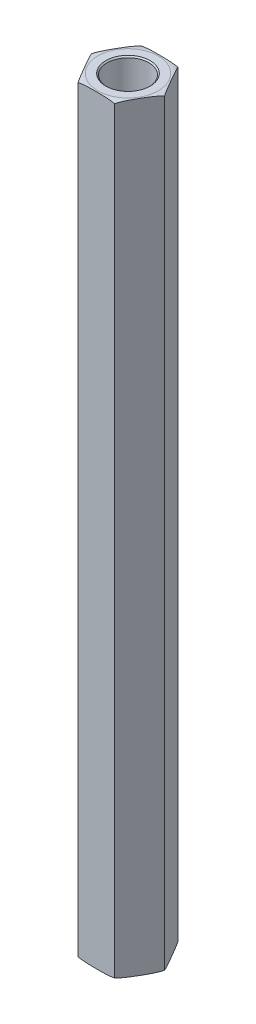
ISO-10303-21;
HEADER;
FILE_DESCRIPTION(('STEP AP214'),'2;1');
FILE_NAME('part.step','',(''),(''),'','','');
FILE_SCHEMA(('AUTOMOTIVE_DESIGN { 1 0 10303 214 1 1 1 1 }'));
ENDSEC;
DATA;
#1=APPLICATION_CONTEXT('core data for automotive mechanical design processes');
#2=APPLICATION_PROTOCOL_DEFINITION('international standard','automotive_design',2000,#1);
#3=PRODUCT_CONTEXT('',#1,'mechanical');
#4=PRODUCT('Part','Part','',(#3));
#5=PRODUCT_RELATED_PRODUCT_CATEGORY('part','',(#4));
#6=PRODUCT_DEFINITION_FORMATION('','',#4);
#7=PRODUCT_DEFINITION_CONTEXT('part definition',#1,'design');
#8=PRODUCT_DEFINITION('design','',#6,#7);
#9=PRODUCT_DEFINITION_SHAPE('','',#8);
#10=(LENGTH_UNIT() NAMED_UNIT(*) SI_UNIT(.MILLI.,.METRE.));
#11=(NAMED_UNIT(*) PLANE_ANGLE_UNIT() SI_UNIT($,.RADIAN.));
#12=(NAMED_UNIT(*) SI_UNIT($,.STERADIAN.) SOLID_ANGLE_UNIT());
#13=UNCERTAINTY_MEASURE_WITH_UNIT(LENGTH_MEASURE(1.E-05),#10,'distance_accuracy_value','');
#14=(GEOMETRIC_REPRESENTATION_CONTEXT(3) GLOBAL_UNCERTAINTY_ASSIGNED_CONTEXT((#13)) GLOBAL_UNIT_ASSIGNED_CONTEXT((#10,
#11,#12)) REPRESENTATION_CONTEXT('',''));
#15=CARTESIAN_POINT('',(0.,0.,0.));
#16=DIRECTION('',(0.,0.,1.));
#17=DIRECTION('',(1.,0.,0.));
#18=AXIS2_PLACEMENT_3D('',#15,#16,#17);
#19=CARTESIAN_POINT('',(0.,25.4,0.));
#20=DIRECTION('',(0.,1.,0.));
#21=DIRECTION('',(0.,0.,1.));
#22=AXIS2_PLACEMENT_3D('',#19,#20,#21);
#23=PLANE('',#22);
#24=CARTESIAN_POINT('',(0.,25.4,0.));
#25=DIRECTION('',(0.,1.,0.));
#26=DIRECTION('',(0.,0.,1.));
#27=AXIS2_PLACEMENT_3D('',#24,#25,#26);
#28=CIRCLE('',#27,2.0955);
#29=CARTESIAN_POINT('',(0.,25.4,2.0955));
#30=VERTEX_POINT('',#29);
#31=EDGE_CURVE('E301',#30,#30,#28,.T.);
#32=ORIENTED_EDGE('',*,*,#31,.T.);
#33=EDGE_LOOP('',(#32));
#34=FACE_BOUND('',#33,.T.);
#35=ADVANCED_FACE('F15',(#34),#23,.T.);
#36=CARTESIAN_POINT('',(0.,-25.4,0.));
#37=DIRECTION('',(0.,-1.,0.));
#38=DIRECTION('',(0.,0.,-1.));
#39=AXIS2_PLACEMENT_3D('',#36,#37,#38);
#40=PLANE('',#39);
#41=CARTESIAN_POINT('',(0.,-25.4,0.));
#42=DIRECTION('',(0.,-1.,0.));
#43=DIRECTION('',(0.,0.,-1.));
#44=AXIS2_PLACEMENT_3D('',#41,#42,#43);
#45=CIRCLE('',#44,2.0955);
#46=CARTESIAN_POINT('',(0.,-25.4,-2.0955));
#47=VERTEX_POINT('',#46);
#48=EDGE_CURVE('E311',#47,#47,#45,.T.);
#49=ORIENTED_EDGE('',*,*,#48,.T.);
#50=EDGE_LOOP('',(#49));
#51=FACE_BOUND('',#50,.T.);
#52=ADVANCED_FACE('F412',(#51),#40,.T.);
#53=CARTESIAN_POINT('',(0.,25.4,0.));
#54=DIRECTION('',(0.,1.,0.));
#55=DIRECTION('',(0.,0.,1.));
#56=AXIS2_PLACEMENT_3D('',#53,#54,#55);
#57=CYLINDRICAL_SURFACE('',#56,2.0955);
#58=CARTESIAN_POINT('',(0.,37.9730000000222,0.));
#59=DIRECTION('',(0.,1.,0.));
#60=DIRECTION('',(0.,0.,1.));
#61=AXIS2_PLACEMENT_3D('',#58,#59,#60);
#62=CIRCLE('',#61,2.09549999999581);
#63=CARTESIAN_POINT('',(0.,37.9730000000222,2.09549999999581));
#64=VERTEX_POINT('',#63);
#65=EDGE_CURVE('E313',#64,#64,#62,.T.);
#66=ORIENTED_EDGE('',*,*,#65,.T.);
#67=EDGE_LOOP('',(#66));
#68=FACE_BOUND('',#67,.T.);
#69=ORIENTED_EDGE('',*,*,#31,.F.);
#70=EDGE_LOOP('',(#69));
#71=FACE_BOUND('',#70,.T.);
#72=ADVANCED_FACE('F323',(#68,#71),#57,.F.);
#73=CARTESIAN_POINT('',(0.,-25.4,0.));
#74=DIRECTION('',(0.,-1.,0.));
#75=DIRECTION('',(0.,0.,-1.));
#76=AXIS2_PLACEMENT_3D('',#73,#74,#75);
#77=CYLINDRICAL_SURFACE('',#76,2.0955);
#78=ORIENTED_EDGE('',*,*,#48,.F.);
#79=EDGE_LOOP('',(#78));
#80=FACE_BOUND('',#79,.T.);
#81=CARTESIAN_POINT('',(0.,-37.9729999999654,0.));
#82=DIRECTION('',(0.,-1.,0.));
#83=DIRECTION('',(0.,0.,-1.));
#84=AXIS2_PLACEMENT_3D('',#81,#82,#83);
#85=CIRCLE('',#84,2.09549999999581);
#86=CARTESIAN_POINT('',(0.,-37.9729999999654,-2.09549999999581));
#87=VERTEX_POINT('',#86);
#88=EDGE_CURVE('E153',#87,#87,#85,.T.);
#89=ORIENTED_EDGE('',*,*,#88,.T.);
#90=EDGE_LOOP('',(#89));
#91=FACE_BOUND('',#90,.T.);
#92=ADVANCED_FACE('F328',(#80,#91),#77,.F.);
#93=CARTESIAN_POINT('',(0.,38.099999999929,0.));
#94=DIRECTION('',(0.,1.,0.));
#95=DIRECTION('',(0.,0.,1.));
#96=AXIS2_PLACEMENT_3D('',#93,#94,#95);
#97=CONICAL_SURFACE('',#96,2.22249999990254,0.785398163397448);
#98=CARTESIAN_POINT('',(0.,38.1000000000427,0.));
#99=DIRECTION('',(0.,1.,0.));
#100=DIRECTION('',(0.,0.,1.));
#101=AXIS2_PLACEMENT_3D('',#98,#99,#100);
#102=CIRCLE('',#101,2.22250000001623);
#103=CARTESIAN_POINT('',(0.,38.1000000000427,2.22250000001623));
#104=VERTEX_POINT('',#103);
#105=EDGE_CURVE('E78',#104,#104,#102,.T.);
#106=ORIENTED_EDGE('',*,*,#105,.T.);
#107=EDGE_LOOP('',(#106));
#108=FACE_BOUND('',#107,.T.);
#109=ORIENTED_EDGE('',*,*,#65,.F.);
#110=EDGE_LOOP('',(#109));
#111=FACE_BOUND('',#110,.T.);
#112=ADVANCED_FACE('F326',(#108,#111),#97,.F.);
#113=CARTESIAN_POINT('',(-3.66617420935413,38.1,0.));
#114=DIRECTION('',(0.866025403784439,0.,-0.499999999999999));
#115=DIRECTION('',(-0.499999999999999,0.,-0.866025403784439));
#116=AXIS2_PLACEMENT_3D('',#113,#114,#115);
#117=PLANE('',#116);
#118=DIRECTION('',(0.,1.,0.));
#119=VECTOR('',#118,1.);
#120=CARTESIAN_POINT('',(-1.83308710467708,38.1,3.175));
#121=LINE('',#120,#119);
#122=CARTESIAN_POINT('',(-1.83308710467708,-37.973,3.17499999999999));
#123=VERTEX_POINT('',#122);
#124=CARTESIAN_POINT('',(-1.83308710467706,37.973,3.175));
#125=VERTEX_POINT('',#124);
#126=EDGE_CURVE('E74',#123,#125,#121,.T.);
#127=ORIENTED_EDGE('',*,*,#126,.T.);
#128=CARTESIAN_POINT('',(-3.66617420935412,37.973,0.));
#129=CARTESIAN_POINT('',(-3.62797961467394,37.9889014148997,0.0661549785605816));
#130=CARTESIAN_POINT('',(-3.58956810864155,38.0024886076105,0.132685658603915));
#131=CARTESIAN_POINT('',(-3.51249051795707,38.0258161979402,0.266187961794431));
#132=CARTESIAN_POINT('',(-3.47382473049842,38.0355604771397,0.333159070187479));
#133=CARTESIAN_POINT('',(-3.39641631867867,38.0519966530451,0.467234372392503));
#134=CARTESIAN_POINT('',(-3.35767399633305,38.0586945328669,0.534338043098323));
#135=CARTESIAN_POINT('',(-3.28009834620104,38.0697767572932,0.668703010557154));
#136=CARTESIAN_POINT('',(-3.24126499587761,38.074160450474,0.735964346345458));
#137=CARTESIAN_POINT('',(-3.16354065964303,38.0812403004263,0.870586845688321));
#138=CARTESIAN_POINT('',(-3.12464965374463,38.0839355237591,0.937948043861809));
#139=CARTESIAN_POINT('',(-3.04685144594578,38.0881531983713,1.07269849250722));
#140=CARTESIAN_POINT('',(-3.00794424351953,38.0896756080272,1.14008774388984));
#141=CARTESIAN_POINT('',(-2.93051517598855,38.091922705889,1.27419882283618));
#142=CARTESIAN_POINT('',(-2.89199336248915,38.0926552468181,1.34092056101683));
#143=CARTESIAN_POINT('',(-2.81494778346123,38.0935767302574,1.47436741839176));
#144=CARTESIAN_POINT('',(-2.77642401791417,38.0937656658949,1.54109253761813));
#145=CARTESIAN_POINT('',(-2.69935964430989,38.0936659966806,1.67457194815423));
#146=CARTESIAN_POINT('',(-2.66081903631797,38.0933771811765,1.74132623935083));
#147=CARTESIAN_POINT('',(-2.58373908085303,38.092221986219,1.87483263846124));
#148=CARTESIAN_POINT('',(-2.54519973341218,38.0913555970386,1.94158474631935));
#149=CARTESIAN_POINT('',(-2.46812969629742,38.0887861940656,2.07507396634334));
#150=CARTESIAN_POINT('',(-2.42959900625935,38.0870832271616,2.14181107913996));
#151=CARTESIAN_POINT('',(-2.35255651340877,38.0824387229726,2.27525259109893));
#152=CARTESIAN_POINT('',(-2.3140447097541,38.0794972471358,2.34195699171993));
#153=CARTESIAN_POINT('',(-2.25084206239913,38.0732174124748,2.4514271881116));
#154=CARTESIAN_POINT('',(-2.2261384933698,38.0703980110463,2.49421502479868));
#155=CARTESIAN_POINT('',(-2.17676945272202,38.0638696794303,2.57972471152158));
#156=CARTESIAN_POINT('',(-2.15210397034159,38.0601610809139,2.62244658019767));
#157=CARTESIAN_POINT('',(-2.10282753811676,38.0516802711496,2.70779586442681));
#158=CARTESIAN_POINT('',(-2.07821657107511,38.0469084657008,2.75042330976635));
#159=CARTESIAN_POINT('',(-2.02900094683535,38.0360987712516,2.83566727147582));
#160=CARTESIAN_POINT('',(-2.00439646085451,38.0300577313084,2.87828349128876));
#161=CARTESIAN_POINT('',(-1.95527325900925,38.0165138354161,2.96336737271521));
#162=CARTESIAN_POINT('',(-1.93075459617607,38.0090101978029,3.00583494247592));
#163=CARTESIAN_POINT('',(-1.88182157373168,37.9923203507084,3.09058942351751));
#164=CARTESIAN_POINT('',(-1.85740744053269,37.9831314978033,3.13287594264093));
#165=CARTESIAN_POINT('',(-1.83308710467707,37.973,3.175));
#166=B_SPLINE_CURVE_WITH_KNOTS('',3,(#128,#129,#130,#131,#132,#133,#134,#135,#136,#137,#138,
#139,#140,#141,#142,#143,#144,#145,#146,#147,#148,#149,#150,#151,#152,#153,#154,#155,#156,#157,
#158,#159,#160,#161,#162,#163,#164,#165),.UNSPECIFIED.,.F.,.F.,(4,2,2,2,2,2,2,2,2,2,2,2,2,2,2,2,
2,2,4),(0.,0.233977307817999,0.467717675040806,0.700996973557669,0.934341903229975,
1.16781571967268,1.40129782179858,1.63243665809709,1.86357841666662,2.09482211846345,
2.32606971471551,2.55730435147459,2.7885275169448,2.93698369265143,3.08538458004518,
3.23372892334618,3.38244598546634,3.53124274626094,3.68027493713584),.UNSPECIFIED.);
#167=CARTESIAN_POINT('',(-3.66617420935412,37.973,0.));
#168=VERTEX_POINT('',#167);
#169=EDGE_CURVE('E67',#168,#125,#166,.T.);
#170=ORIENTED_EDGE('',*,*,#169,.F.);
#171=DIRECTION('',(0.,1.,0.));
#172=VECTOR('',#171,1.);
#173=CARTESIAN_POINT('',(-3.66617420935413,38.1,0.));
#174=LINE('',#173,#172);
#175=CARTESIAN_POINT('',(-3.66617420935413,-37.973,0.));
#176=VERTEX_POINT('',#175);
#177=EDGE_CURVE('E71',#168,#176,#174,.F.);
#178=ORIENTED_EDGE('',*,*,#177,.T.);
#179=CARTESIAN_POINT('',(-1.83308710467707,-37.973,3.17499999999999));
#180=CARTESIAN_POINT('',(-1.87128169935726,-37.9889014148997,3.10884502143941));
#181=CARTESIAN_POINT('',(-1.90969320538964,-38.0024886076105,3.04231434139608));
#182=CARTESIAN_POINT('',(-1.98677079607412,-38.0258161979402,2.90881203820556));
#183=CARTESIAN_POINT('',(-2.02543658353278,-38.0355604771397,2.84184092981252));
#184=CARTESIAN_POINT('',(-2.10284499535253,-38.0519966530451,2.70776562760749));
#185=CARTESIAN_POINT('',(-2.14158731769815,-38.0586945328669,2.64066195690167));
#186=CARTESIAN_POINT('',(-2.21916296783016,-38.0697767572932,2.50629698944284));
#187=CARTESIAN_POINT('',(-2.25799631815359,-38.074160450474,2.43903565365454));
#188=CARTESIAN_POINT('',(-2.33572065438817,-38.0812403004263,2.30441315431167));
#189=CARTESIAN_POINT('',(-2.37461166028657,-38.0839355237591,2.23705195613819));
#190=CARTESIAN_POINT('',(-2.45240986808542,-38.0881531983713,2.10230150749278));
#191=CARTESIAN_POINT('',(-2.49131707051166,-38.0896756080272,2.03491225611015));
#192=CARTESIAN_POINT('',(-2.56874613804264,-38.091922705889,1.90080117716381));
#193=CARTESIAN_POINT('',(-2.60726795154204,-38.0926552468181,1.83407943898316));
#194=CARTESIAN_POINT('',(-2.68431353056997,-38.0935767302574,1.70063258160823));
#195=CARTESIAN_POINT('',(-2.72283729611702,-38.0937656658949,1.63390746238186));
#196=CARTESIAN_POINT('',(-2.79990166972131,-38.0936659966806,1.50042805184577));
#197=CARTESIAN_POINT('',(-2.83844227771323,-38.0933771811765,1.43367376064917));
#198=CARTESIAN_POINT('',(-2.91552223317816,-38.092221986219,1.30016736153875));
#199=CARTESIAN_POINT('',(-2.95406158061902,-38.0913555970386,1.23341525368064));
#200=CARTESIAN_POINT('',(-3.03113161773378,-38.0887861940656,1.09992603365665));
#201=CARTESIAN_POINT('',(-3.06966230777185,-38.0870832271616,1.03318892086004));
#202=CARTESIAN_POINT('',(-3.14670480062243,-38.0824387229726,0.899747408901061));
#203=CARTESIAN_POINT('',(-3.1852166042771,-38.0794972471358,0.833043008280059));
#204=CARTESIAN_POINT('',(-3.24841925163207,-38.0732174124748,0.723572811888393));
#205=CARTESIAN_POINT('',(-3.27312282066139,-38.0703980110463,0.680784975201311));
#206=CARTESIAN_POINT('',(-3.32249186130918,-38.0638696794303,0.595275288478418));
#207=CARTESIAN_POINT('',(-3.3471573436896,-38.0601610809139,0.552553419802327));
#208=CARTESIAN_POINT('',(-3.39643377591444,-38.0516802711496,0.467204135573185));
#209=CARTESIAN_POINT('',(-3.42104474295609,-38.0469084657008,0.424576690233643));
#210=CARTESIAN_POINT('',(-3.47026036719584,-38.0360987712516,0.339332728524168));
#211=CARTESIAN_POINT('',(-3.49486485317669,-38.0300577313084,0.296716508711231));
#212=CARTESIAN_POINT('',(-3.54398805502195,-38.0165138354161,0.211632627284777));
#213=CARTESIAN_POINT('',(-3.56850671785512,-38.0090101978029,0.169165057524069));
#214=CARTESIAN_POINT('',(-3.61743974029951,-37.9923203507084,0.0844105764824764));
#215=CARTESIAN_POINT('',(-3.64185387349851,-37.9831314978033,0.0421240573590603));
#216=CARTESIAN_POINT('',(-3.66617420935413,-37.973,0.));
#217=B_SPLINE_CURVE_WITH_KNOTS('',3,(#179,#180,#181,#182,#183,#184,#185,#186,#187,#188,#189,
#190,#191,#192,#193,#194,#195,#196,#197,#198,#199,#200,#201,#202,#203,#204,#205,#206,#207,#208,
#209,#210,#211,#212,#213,#214,#215,#216),.UNSPECIFIED.,.F.,.F.,(4,2,2,2,2,2,2,2,2,2,2,2,2,2,2,2,
2,2,4),(0.,0.233977307817998,0.467717675040806,0.700996973557669,0.934341903229975,
1.16781571967268,1.40129782179858,1.63243665809709,1.86357841666662,2.09482211846345,
2.32606971471551,2.55730435147459,2.7885275169448,2.93698369265143,3.08538458004518,
3.23372892334618,3.38244598546635,3.53124274626094,3.68027493713584),.UNSPECIFIED.);
#218=EDGE_CURVE('E86',#123,#176,#217,.T.);
#219=ORIENTED_EDGE('',*,*,#218,.F.);
#220=EDGE_LOOP('',(#127,#170,#178,#219));
#221=FACE_BOUND('',#220,.T.);
#222=ADVANCED_FACE('F69',(#221),#117,.F.);
#223=CARTESIAN_POINT('',(0.,-38.0999999998153,0.));
#224=DIRECTION('',(0.,-1.,0.));
#225=DIRECTION('',(0.,0.,-1.));
#226=AXIS2_PLACEMENT_3D('',#223,#224,#225);
#227=CONICAL_SURFACE('',#226,2.2224999998457,0.785398163397448);
#228=ORIENTED_EDGE('',*,*,#88,.F.);
#229=EDGE_LOOP('',(#228));
#230=FACE_BOUND('',#229,.T.);
#231=CARTESIAN_POINT('',(0.,-38.099999999929,0.));
#232=DIRECTION('',(0.,-1.,0.));
#233=DIRECTION('',(0.,0.,-1.));
#234=AXIS2_PLACEMENT_3D('',#231,#232,#233);
#235=CIRCLE('',#234,2.22249999995938);
#236=CARTESIAN_POINT('',(0.,-38.099999999929,-2.22249999995938));
#237=VERTEX_POINT('',#236);
#238=EDGE_CURVE('E277',#237,#237,#235,.F.);
#239=ORIENTED_EDGE('',*,*,#238,.F.);
#240=EDGE_LOOP('',(#239));
#241=FACE_BOUND('',#240,.T.);
#242=ADVANCED_FACE('F335',(#230,#241),#227,.F.);
#243=CARTESIAN_POINT('',(-1.83308710467707,38.1,-3.175));
#244=DIRECTION('',(0.,-1.,0.));
#245=DIRECTION('',(0.,0.,-1.));
#246=AXIS2_PLACEMENT_3D('',#243,#244,#245);
#247=PLANE('',#246);
#248=CARTESIAN_POINT('',(0.,38.1,0.));
#249=DIRECTION('',(0.,-1.,0.));
#250=DIRECTION('',(0.,0.,1.));
#251=AXIS2_PLACEMENT_3D('',#248,#249,#250);
#252=CIRCLE('',#251,3.03117420935412);
#253=CARTESIAN_POINT('',(0.,38.1,3.03117420935411));
#254=VERTEX_POINT('',#253);
#255=CARTESIAN_POINT('',(0.,38.1,-3.03117420935411));
#256=VERTEX_POINT('',#255);
#257=EDGE_CURVE('E77',#254,#256,#252,.T.);
#258=ORIENTED_EDGE('',*,*,#257,.F.);
#259=CARTESIAN_POINT('',(0.,38.1,0.));
#260=DIRECTION('',(0.,-1.,0.));
#261=DIRECTION('',(0.,0.,-1.));
#262=AXIS2_PLACEMENT_3D('',#259,#260,#261);
#263=CIRCLE('',#262,3.03117420935412);
#264=EDGE_CURVE('E138',#256,#254,#263,.T.);
#265=ORIENTED_EDGE('',*,*,#264,.F.);
#266=EDGE_LOOP('',(#258,#265));
#267=FACE_BOUND('',#266,.T.);
#268=ORIENTED_EDGE('',*,*,#105,.F.);
#269=EDGE_LOOP('',(#268));
#270=FACE_BOUND('',#269,.T.);
#271=ADVANCED_FACE('F114',(#267,#270),#247,.F.);
#272=CARTESIAN_POINT('',(-1.83308710467707,38.1,-3.175));
#273=DIRECTION('',(0.866025403784439,0.,0.5));
#274=DIRECTION('',(0.5,0.,-0.866025403784439));
#275=AXIS2_PLACEMENT_3D('',#272,#273,#274);
#276=PLANE('',#275);
#277=ORIENTED_EDGE('',*,*,#177,.F.);
#278=CARTESIAN_POINT('',(-1.83308710467706,37.973,-3.17500000000001));
#279=CARTESIAN_POINT('',(-1.87128169935724,37.9889014148997,-3.10884502143944));
#280=CARTESIAN_POINT('',(-1.90969320538963,38.0024886076105,-3.04231434139611));
#281=CARTESIAN_POINT('',(-1.98677079607411,38.0258161979402,-2.90881203820559));
#282=CARTESIAN_POINT('',(-2.02543658353276,38.0355604771397,-2.84184092981255));
#283=CARTESIAN_POINT('',(-2.10284499535251,38.0519966530451,-2.70776562760753));
#284=CARTESIAN_POINT('',(-2.14158731769812,38.0586945328669,-2.64066195690171));
#285=CARTESIAN_POINT('',(-2.21916296783013,38.0697767572932,-2.50629698944289));
#286=CARTESIAN_POINT('',(-2.25799631815356,38.074160450474,-2.43903565365458));
#287=CARTESIAN_POINT('',(-2.33572065438814,38.0812403004263,-2.30441315431172));
#288=CARTESIAN_POINT('',(-2.37461166028654,38.0839355237591,-2.23705195613824));
#289=CARTESIAN_POINT('',(-2.45240986808539,38.0881531983713,-2.10230150749283));
#290=CARTESIAN_POINT('',(-2.49131707051163,38.0896756080272,-2.03491225611021));
#291=CARTESIAN_POINT('',(-2.56874613804261,38.091922705889,-1.90080117716388));
#292=CARTESIAN_POINT('',(-2.607267951542,38.0926552468181,-1.83407943898323));
#293=CARTESIAN_POINT('',(-2.68431353056993,38.0935767302574,-1.7006325816083));
#294=CARTESIAN_POINT('',(-2.72283729611698,38.0937656658949,-1.63390746238193));
#295=CARTESIAN_POINT('',(-2.79990166972127,38.0936659966806,-1.50042805184584));
#296=CARTESIAN_POINT('',(-2.83844227771318,38.0933771811765,-1.43367376064925));
#297=CARTESIAN_POINT('',(-2.91552223317812,38.092221986219,-1.30016736153884));
#298=CARTESIAN_POINT('',(-2.95406158061897,38.0913555970386,-1.23341525368073));
#299=CARTESIAN_POINT('',(-3.03113161773373,38.0887861940656,-1.09992603365674));
#300=CARTESIAN_POINT('',(-3.0696623077718,38.0870832271616,-1.03318892086013));
#301=CARTESIAN_POINT('',(-3.14670480062238,38.0824387229726,-0.899747408901157));
#302=CARTESIAN_POINT('',(-3.18521660427705,38.0794972471358,-0.833043008280158));
#303=CARTESIAN_POINT('',(-3.24841925163202,38.0732174124748,-0.723572811888488));
#304=CARTESIAN_POINT('',(-3.27312282066135,38.0703980110463,-0.6807849752014));
#305=CARTESIAN_POINT('',(-3.32249186130914,38.0638696794303,-0.595275288478496));
#306=CARTESIAN_POINT('',(-3.34715734368956,38.0601610809139,-0.5525534198024));
#307=CARTESIAN_POINT('',(-3.39643377591441,38.0516802711496,-0.467204135573248));
#308=CARTESIAN_POINT('',(-3.42104474295606,38.0469084657008,-0.424576690233701));
#309=CARTESIAN_POINT('',(-3.47026036719582,38.0360987712516,-0.339332728524217));
#310=CARTESIAN_POINT('',(-3.49486485317667,38.0300577313084,-0.296716508711274));
#311=CARTESIAN_POINT('',(-3.54398805502194,38.0165138354161,-0.21163262728481));
#312=CARTESIAN_POINT('',(-3.56850671785511,38.0090101978029,-0.169165057524097));
#313=CARTESIAN_POINT('',(-3.61743974029951,37.9923203507084,-0.0844105764824943));
#314=CARTESIAN_POINT('',(-3.64185387349851,37.9831314978033,-0.0421240573590734));
#315=CARTESIAN_POINT('',(-3.66617420935413,37.973,0.));
#316=B_SPLINE_CURVE_WITH_KNOTS('',3,(#278,#279,#280,#281,#282,#283,#284,#285,#286,#287,#288,
#289,#290,#291,#292,#293,#294,#295,#296,#297,#298,#299,#300,#301,#302,#303,#304,#305,#306,#307,
#308,#309,#310,#311,#312,#313,#314,#315),.UNSPECIFIED.,.F.,.F.,(4,2,2,2,2,2,2,2,2,2,2,2,2,2,2,2,
2,2,4),(0.,0.233977307817992,0.467717675040792,0.700996973557648,0.934341903229947,
1.16781571967264,1.40129782179854,1.63243665809704,1.86357841666656,2.09482211846338,
2.32606971471544,2.55730435147451,2.78852751694472,2.93698369265136,3.08538458004513,
3.23372892334615,3.38244598546633,3.53124274626095,3.68027493713586),.UNSPECIFIED.);
#317=CARTESIAN_POINT('',(-1.83308710467705,37.973,-3.17500000000001));
#318=VERTEX_POINT('',#317);
#319=EDGE_CURVE('E83',#318,#168,#316,.T.);
#320=ORIENTED_EDGE('',*,*,#319,.F.);
#321=DIRECTION('',(0.,1.,0.));
#322=VECTOR('',#321,1.);
#323=CARTESIAN_POINT('',(-1.83308710467705,38.1,-3.175));
#324=LINE('',#323,#322);
#325=CARTESIAN_POINT('',(-1.83308710467707,-37.973,-3.175));
#326=VERTEX_POINT('',#325);
#327=EDGE_CURVE('E176',#318,#326,#324,.F.);
#328=ORIENTED_EDGE('',*,*,#327,.T.);
#329=CARTESIAN_POINT('',(-3.66617420935413,-37.973,0.));
#330=CARTESIAN_POINT('',(-3.62797961467395,-37.9889014148997,-0.0661549785605743));
#331=CARTESIAN_POINT('',(-3.58956810864156,-38.0024886076105,-0.132685658603907));
#332=CARTESIAN_POINT('',(-3.51249051795708,-38.0258161979402,-0.266187961794421));
#333=CARTESIAN_POINT('',(-3.47382473049843,-38.0355604771397,-0.333159070187467));
#334=CARTESIAN_POINT('',(-3.39641631867868,-38.0519966530451,-0.467234372392488));
#335=CARTESIAN_POINT('',(-3.35767399633306,-38.0586945328669,-0.534338043098307));
#336=CARTESIAN_POINT('',(-3.28009834620105,-38.0697767572932,-0.668703010557135));
#337=CARTESIAN_POINT('',(-3.24126499587762,-38.074160450474,-0.735964346345438));
#338=CARTESIAN_POINT('',(-3.16354065964304,-38.0812403004263,-0.870586845688298));
#339=CARTESIAN_POINT('',(-3.12464965374464,-38.0839355237591,-0.937948043861785));
#340=CARTESIAN_POINT('',(-3.0468514459458,-38.0881531983713,-1.07269849250719));
#341=CARTESIAN_POINT('',(-3.00794424351955,-38.0896756080272,-1.14008774388981));
#342=CARTESIAN_POINT('',(-2.93051517598857,-38.091922705889,-1.27419882283615));
#343=CARTESIAN_POINT('',(-2.89199336248918,-38.0926552468181,-1.3409205610168));
#344=CARTESIAN_POINT('',(-2.81494778346125,-38.0935767302574,-1.47436741839173));
#345=CARTESIAN_POINT('',(-2.7764240179142,-38.0937656658949,-1.5410925376181));
#346=CARTESIAN_POINT('',(-2.69935964430991,-38.0936659966806,-1.67457194815419));
#347=CARTESIAN_POINT('',(-2.66081903631799,-38.0933771811765,-1.74132623935079));
#348=CARTESIAN_POINT('',(-2.58373908085306,-38.092221986219,-1.8748326384612));
#349=CARTESIAN_POINT('',(-2.54519973341221,-38.0913555970386,-1.94158474631931));
#350=CARTESIAN_POINT('',(-2.46812969629744,-38.0887861940656,-2.0750739663433));
#351=CARTESIAN_POINT('',(-2.42959900625938,-38.0870832271616,-2.14181107913991));
#352=CARTESIAN_POINT('',(-2.35255651340879,-38.0824387229726,-2.27525259109889));
#353=CARTESIAN_POINT('',(-2.31404470975413,-38.0794972471358,-2.34195699171989));
#354=CARTESIAN_POINT('',(-2.25084206239916,-38.0732174124748,-2.45142718811155));
#355=CARTESIAN_POINT('',(-2.22613849336983,-38.0703980110463,-2.49421502479864));
#356=CARTESIAN_POINT('',(-2.17676945272204,-38.0638696794303,-2.57972471152153));
#357=CARTESIAN_POINT('',(-2.15210397034162,-38.0601610809139,-2.62244658019763));
#358=CARTESIAN_POINT('',(-2.10282753811678,-38.0516802711496,-2.70779586442677));
#359=CARTESIAN_POINT('',(-2.07821657107513,-38.0469084657008,-2.75042330976632));
#360=CARTESIAN_POINT('',(-2.02900094683537,-38.0360987712516,-2.8356672714758));
#361=CARTESIAN_POINT('',(-2.00439646085452,-38.0300577313084,-2.87828349128874));
#362=CARTESIAN_POINT('',(-1.95527325900926,-38.0165138354161,-2.96336737271519));
#363=CARTESIAN_POINT('',(-1.93075459617608,-38.0090101978029,-3.0058349424759));
#364=CARTESIAN_POINT('',(-1.88182157373169,-37.9923203507084,-3.0905894235175));
#365=CARTESIAN_POINT('',(-1.85740744053269,-37.9831314978033,-3.13287594264092));
#366=CARTESIAN_POINT('',(-1.83308710467707,-37.973,-3.17499999999999));
#367=B_SPLINE_CURVE_WITH_KNOTS('',3,(#329,#330,#331,#332,#333,#334,#335,#336,#337,#338,#339,
#340,#341,#342,#343,#344,#345,#346,#347,#348,#349,#350,#351,#352,#353,#354,#355,#356,#357,#358,
#359,#360,#361,#362,#363,#364,#365,#366),.UNSPECIFIED.,.F.,.F.,(4,2,2,2,2,2,2,2,2,2,2,2,2,2,2,2,
2,2,4),(0.,0.233977307817996,0.467717675040799,0.700996973557657,0.934341903229959,
1.16781571967266,1.40129782179856,1.63243665809706,1.86357841666659,2.09482211846341,
2.32606971471547,2.55730435147455,2.78852751694475,2.93698369265139,3.08538458004515,
3.23372892334615,3.38244598546633,3.53124274626093,3.68027493713584),.UNSPECIFIED.);
#368=EDGE_CURVE('E85',#176,#326,#367,.T.);
#369=ORIENTED_EDGE('',*,*,#368,.F.);
#370=EDGE_LOOP('',(#277,#320,#328,#369));
#371=FACE_BOUND('',#370,.T.);
#372=ADVANCED_FACE('F81',(#371),#276,.F.);
#373=CARTESIAN_POINT('',(-1.83308710467707,38.1,3.175));
#374=DIRECTION('',(0.,0.,-1.));
#375=DIRECTION('',(-1.,0.,0.));
#376=AXIS2_PLACEMENT_3D('',#373,#374,#375);
#377=PLANE('',#376);
#378=DIRECTION('',(0.,1.,0.));
#379=VECTOR('',#378,1.);
#380=CARTESIAN_POINT('',(1.83308710467706,38.1,3.17499999999999));
#381=LINE('',#380,#379);
#382=CARTESIAN_POINT('',(1.83308710467706,-37.973,3.17499999999999));
#383=VERTEX_POINT('',#382);
#384=CARTESIAN_POINT('',(1.83308710467706,37.973,3.17499999999999));
#385=VERTEX_POINT('',#384);
#386=EDGE_CURVE('E178',#383,#385,#381,.T.);
#387=ORIENTED_EDGE('',*,*,#386,.T.);
#388=CARTESIAN_POINT('',(-1.83308710467706,37.973,3.175));
#389=CARTESIAN_POINT('',(-1.73237579828683,37.9939400141518,3.175));
#390=CARTESIAN_POINT('',(-1.63096506893486,38.0108853495327,3.175));
#391=CARTESIAN_POINT('',(-1.42767146651469,38.0384971643984,3.175));
#392=CARTESIAN_POINT('',(-1.32579191427254,38.0491875658753,3.175));
#393=CARTESIAN_POINT('',(-1.12177634709138,38.0661280408079,3.175));
#394=CARTESIAN_POINT('',(-1.0196405664338,38.0723812707189,3.175));
#395=CARTESIAN_POINT('',(-0.815663681397376,38.0819028064183,3.175));
#396=CARTESIAN_POINT('',(-0.713823115514574,38.0851834044999,3.175));
#397=CARTESIAN_POINT('',(-0.510018485441651,38.0899454848703,3.175));
#398=CARTESIAN_POINT('',(-0.408054390577977,38.0914254100882,3.175));
#399=CARTESIAN_POINT('',(-0.20406020033787,38.0933146818379,3.175));
#400=CARTESIAN_POINT('',(-0.102030100168935,38.0937234241492,3.175));
#401=CARTESIAN_POINT('',(0.102030100168936,38.0937234241492,3.175));
#402=CARTESIAN_POINT('',(0.204060200337871,38.0933146818379,3.17499999999999));
#403=CARTESIAN_POINT('',(0.408054390577979,38.0914254100882,3.17499999999999));
#404=CARTESIAN_POINT('',(0.510018485441654,38.0899454848703,3.17499999999999));
#405=CARTESIAN_POINT('',(0.713823115514577,38.0851834044999,3.17499999999999));
#406=CARTESIAN_POINT('',(0.81566368139738,38.0819028064183,3.17499999999999));
#407=CARTESIAN_POINT('',(1.0196405664338,38.0723812707189,3.17499999999999));
#408=CARTESIAN_POINT('',(1.12177634709138,38.0661280408079,3.17499999999999));
#409=CARTESIAN_POINT('',(1.32579191427255,38.0491875658753,3.17499999999999));
#410=CARTESIAN_POINT('',(1.4276714665147,38.0384971643984,3.17499999999999));
#411=CARTESIAN_POINT('',(1.63096506893487,38.0108853495327,3.17499999999999));
#412=CARTESIAN_POINT('',(1.73237579828684,37.9939400141518,3.17499999999999));
#413=CARTESIAN_POINT('',(1.83308710467707,37.973,3.17499999999999));
#414=B_SPLINE_CURVE_WITH_KNOTS('',3,(#388,#389,#390,#391,#392,#393,#394,#395,#396,#397,#398,
#399,#400,#401,#402,#403,#404,#405,#406,#407,#408,#409,#410,#411,#412,#413),.UNSPECIFIED.,.F.,
.F.,(4,2,2,2,2,2,2,2,2,2,2,2,4),(0.,0.308333242342807,0.615479423308236,0.922406891130009,
1.2280592962085,1.53397581645216,1.84006485747889,2.14615389850562,2.45207041874928,
2.75772282382777,3.06465029164955,3.37179647261497,3.68012971495778),.UNSPECIFIED.);
#415=EDGE_CURVE('E272',#125,#385,#414,.T.);
#416=ORIENTED_EDGE('',*,*,#415,.F.);
#417=ORIENTED_EDGE('',*,*,#126,.F.);
#418=CARTESIAN_POINT('',(1.83308710467706,-37.973,3.17499999999999));
#419=CARTESIAN_POINT('',(1.73237579828684,-37.9939400141518,3.17499999999999));
#420=CARTESIAN_POINT('',(1.63096506893486,-38.0108853495327,3.17499999999999));
#421=CARTESIAN_POINT('',(1.4276714665147,-38.0384971643984,3.17499999999999));
#422=CARTESIAN_POINT('',(1.32579191427254,-38.0491875658753,3.17499999999999));
#423=CARTESIAN_POINT('',(1.12177634709138,-38.0661280408079,3.17499999999999));
#424=CARTESIAN_POINT('',(1.0196405664338,-38.0723812707189,3.17499999999999));
#425=CARTESIAN_POINT('',(0.815663681397379,-38.0819028064183,3.17499999999999));
#426=CARTESIAN_POINT('',(0.713823115514575,-38.0851834044999,3.17499999999999));
#427=CARTESIAN_POINT('',(0.510018485441653,-38.0899454848703,3.17499999999999));
#428=CARTESIAN_POINT('',(0.408054390577978,-38.0914254100882,3.17499999999999));
#429=CARTESIAN_POINT('',(0.204060200337871,-38.0933146818379,3.17499999999999));
#430=CARTESIAN_POINT('',(0.102030100168936,-38.0937234241492,3.175));
#431=CARTESIAN_POINT('',(-0.102030100168936,-38.0937234241492,3.175));
#432=CARTESIAN_POINT('',(-0.204060200337873,-38.0933146818379,3.175));
#433=CARTESIAN_POINT('',(-0.408054390577981,-38.0914254100882,3.175));
#434=CARTESIAN_POINT('',(-0.510018485441657,-38.0899454848703,3.175));
#435=CARTESIAN_POINT('',(-0.713823115514581,-38.0851834044999,3.175));
#436=CARTESIAN_POINT('',(-0.815663681397385,-38.0819028064183,3.175));
#437=CARTESIAN_POINT('',(-1.01964056643381,-38.0723812707189,3.175));
#438=CARTESIAN_POINT('',(-1.12177634709139,-38.0661280408079,3.175));
#439=CARTESIAN_POINT('',(-1.32579191427255,-38.0491875658753,3.175));
#440=CARTESIAN_POINT('',(-1.42767146651471,-38.0384971643984,3.175));
#441=CARTESIAN_POINT('',(-1.63096506893487,-38.0108853495327,3.175));
#442=CARTESIAN_POINT('',(-1.73237579828685,-37.9939400141518,3.175));
#443=CARTESIAN_POINT('',(-1.83308710467708,-37.973,3.175));
#444=B_SPLINE_CURVE_WITH_KNOTS('',3,(#418,#419,#420,#421,#422,#423,#424,#425,#426,#427,#428,
#429,#430,#431,#432,#433,#434,#435,#436,#437,#438,#439,#440,#441,#442,#443),.UNSPECIFIED.,.F.,
.F.,(4,2,2,2,2,2,2,2,2,2,2,2,4),(0.,0.308333242342808,0.615479423308237,0.922406891130011,
1.2280592962085,1.53397581645216,1.84006485747889,2.14615389850562,2.45207041874929,
2.75772282382778,3.06465029164956,3.37179647261499,3.6801297149578),.UNSPECIFIED.);
#445=EDGE_CURVE('E249',#383,#123,#444,.T.);
#446=ORIENTED_EDGE('',*,*,#445,.F.);
#447=EDGE_LOOP('',(#387,#416,#417,#446));
#448=FACE_BOUND('',#447,.T.);
#449=ADVANCED_FACE('F202',(#448),#377,.F.);
#450=CARTESIAN_POINT('',(-1.83308710467707,-38.1,-3.175));
#451=DIRECTION('',(0.,-1.,0.));
#452=DIRECTION('',(0.,0.,-1.));
#453=AXIS2_PLACEMENT_3D('',#450,#451,#452);
#454=PLANE('',#453);
#455=CARTESIAN_POINT('',(0.,-38.1,0.));
#456=DIRECTION('',(0.,1.,0.));
#457=DIRECTION('',(0.,0.,1.));
#458=AXIS2_PLACEMENT_3D('',#455,#456,#457);
#459=CIRCLE('',#458,3.0311742093541);
#460=CARTESIAN_POINT('',(0.,-38.1,3.03117420935411));
#461=VERTEX_POINT('',#460);
#462=CARTESIAN_POINT('',(0.,-38.1,-3.03117420935411));
#463=VERTEX_POINT('',#462);
#464=EDGE_CURVE('E188',#461,#463,#459,.T.);
#465=ORIENTED_EDGE('',*,*,#464,.F.);
#466=CARTESIAN_POINT('',(0.,-38.1,0.));
#467=DIRECTION('',(0.,1.,0.));
#468=DIRECTION('',(0.,0.,-1.));
#469=AXIS2_PLACEMENT_3D('',#466,#467,#468);
#470=CIRCLE('',#469,3.0311742093541);
#471=EDGE_CURVE('E181',#461,#463,#470,.F.);
#472=ORIENTED_EDGE('',*,*,#471,.T.);
#473=EDGE_LOOP('',(#465,#472));
#474=FACE_BOUND('',#473,.T.);
#475=ORIENTED_EDGE('',*,*,#238,.T.);
#476=EDGE_LOOP('',(#475));
#477=FACE_BOUND('',#476,.T.);
#478=ADVANCED_FACE('F193',(#474,#477),#454,.T.);
#479=CARTESIAN_POINT('',(1.83308710467706,38.1,3.17499999999999));
#480=DIRECTION('',(-0.866025403784439,0.,-0.5));
#481=DIRECTION('',(-0.5,0.,0.866025403784439));
#482=AXIS2_PLACEMENT_3D('',#479,#480,#481);
#483=PLANE('',#482);
#484=DIRECTION('',(0.,1.,0.));
#485=VECTOR('',#484,1.);
#486=CARTESIAN_POINT('',(3.66617420935412,38.1,0.));
#487=LINE('',#486,#485);
#488=CARTESIAN_POINT('',(3.66617420935412,-37.973,0.));
#489=VERTEX_POINT('',#488);
#490=CARTESIAN_POINT('',(3.66617420935412,37.973,0.));
#491=VERTEX_POINT('',#490);
#492=EDGE_CURVE('E234',#489,#491,#487,.T.);
#493=ORIENTED_EDGE('',*,*,#492,.T.);
#494=CARTESIAN_POINT('',(1.83308710467706,37.973,3.17499999999999));
#495=CARTESIAN_POINT('',(1.87128169935725,37.9889014148997,3.10884502143942));
#496=CARTESIAN_POINT('',(1.90969320538963,38.0024886076105,3.04231434139608));
#497=CARTESIAN_POINT('',(1.98677079607411,38.0258161979402,2.90881203820557));
#498=CARTESIAN_POINT('',(2.02543658353277,38.0355604771397,2.84184092981252));
#499=CARTESIAN_POINT('',(2.10284499535252,38.0519966530451,2.7077656276075));
#500=CARTESIAN_POINT('',(2.14158731769813,38.0586945328669,2.64066195690167));
#501=CARTESIAN_POINT('',(2.21916296783015,38.0697767572932,2.50629698944284));
#502=CARTESIAN_POINT('',(2.25799631815358,38.074160450474,2.43903565365454));
#503=CARTESIAN_POINT('',(2.33572065438816,38.0812403004263,2.30441315431168));
#504=CARTESIAN_POINT('',(2.37461166028656,38.0839355237591,2.23705195613819));
#505=CARTESIAN_POINT('',(2.45240986808541,38.0881531983713,2.10230150749278));
#506=CARTESIAN_POINT('',(2.49131707051165,38.0896756080272,2.03491225611015));
#507=CARTESIAN_POINT('',(2.56874613804263,38.091922705889,1.90080117716381));
#508=CARTESIAN_POINT('',(2.60726795154203,38.0926552468181,1.83407943898317));
#509=CARTESIAN_POINT('',(2.68431353056996,38.0935767302574,1.70063258160823));
#510=CARTESIAN_POINT('',(2.72283729611701,38.0937656658949,1.63390746238186));
#511=CARTESIAN_POINT('',(2.7999016697213,38.0936659966806,1.50042805184577));
#512=CARTESIAN_POINT('',(2.83844227771322,38.0933771811765,1.43367376064917));
#513=CARTESIAN_POINT('',(2.91552223317815,38.092221986219,1.30016736153876));
#514=CARTESIAN_POINT('',(2.95406158061901,38.0913555970386,1.23341525368065));
#515=CARTESIAN_POINT('',(3.03113161773377,38.0887861940656,1.09992603365665));
#516=CARTESIAN_POINT('',(3.06966230777184,38.0870832271616,1.03318892086004));
#517=CARTESIAN_POINT('',(3.14670480062242,38.0824387229726,0.899747408901064));
#518=CARTESIAN_POINT('',(3.18521660427709,38.0794972471358,0.833043008280063));
#519=CARTESIAN_POINT('',(3.24841925163206,38.0732174124748,0.723572811888397));
#520=CARTESIAN_POINT('',(3.27312282066139,38.0703980110463,0.680784975201316));
#521=CARTESIAN_POINT('',(3.32249186130917,38.0638696794303,0.595275288478424));
#522=CARTESIAN_POINT('',(3.34715734368959,38.0601610809139,0.552553419802334));
#523=CARTESIAN_POINT('',(3.39643377591443,38.0516802711496,0.467204135573193));
#524=CARTESIAN_POINT('',(3.42104474295608,38.0469084657008,0.424576690233652));
#525=CARTESIAN_POINT('',(3.47026036719584,38.0360987712516,0.339332728524179));
#526=CARTESIAN_POINT('',(3.49486485317668,38.0300577313084,0.296716508711242));
#527=CARTESIAN_POINT('',(3.54398805502194,38.0165138354161,0.211632627284788));
#528=CARTESIAN_POINT('',(3.56850671785511,38.0090101978029,0.16916505752408));
#529=CARTESIAN_POINT('',(3.6174397402995,37.9923203507084,0.0844105764824873));
#530=CARTESIAN_POINT('',(3.6418538734985,37.9831314978033,0.042124057359072));
#531=CARTESIAN_POINT('',(3.66617420935412,37.973,0.));
#532=B_SPLINE_CURVE_WITH_KNOTS('',3,(#494,#495,#496,#497,#498,#499,#500,#501,#502,#503,#504,
#505,#506,#507,#508,#509,#510,#511,#512,#513,#514,#515,#516,#517,#518,#519,#520,#521,#522,#523,
#524,#525,#526,#527,#528,#529,#530,#531),.UNSPECIFIED.,.F.,.F.,(4,2,2,2,2,2,2,2,2,2,2,2,2,2,2,2,
2,2,4),(0.,0.233977307817998,0.467717675040805,0.700996973557669,0.934341903229977,
1.16781571967268,1.40129782179859,1.63243665809709,1.86357841666662,2.09482211846345,
2.32606971471551,2.5573043514746,2.7885275169448,2.93698369265143,3.08538458004518,
3.23372892334618,3.38244598546634,3.53124274626094,3.68027493713583),.UNSPECIFIED.);
#533=EDGE_CURVE('E267',#385,#491,#532,.T.);
#534=ORIENTED_EDGE('',*,*,#533,.F.);
#535=ORIENTED_EDGE('',*,*,#386,.F.);
#536=CARTESIAN_POINT('',(3.66617420935412,-37.973,0.));
#537=CARTESIAN_POINT('',(3.62797961467393,-37.9889014148997,0.0661549785605814));
#538=CARTESIAN_POINT('',(3.58956810864155,-38.0024886076105,0.132685658603915));
#539=CARTESIAN_POINT('',(3.51249051795707,-38.0258161979402,0.266187961794432));
#540=CARTESIAN_POINT('',(3.47382473049841,-38.0355604771397,0.33315907018748));
#541=CARTESIAN_POINT('',(3.39641631867866,-38.0519966530451,0.467234372392504));
#542=CARTESIAN_POINT('',(3.35767399633305,-38.0586945328669,0.534338043098324));
#543=CARTESIAN_POINT('',(3.28009834620103,-38.0697767572932,0.668703010557156));
#544=CARTESIAN_POINT('',(3.2412649958776,-38.074160450474,0.73596434634546));
#545=CARTESIAN_POINT('',(3.16354065964302,-38.0812403004263,0.870586845688324));
#546=CARTESIAN_POINT('',(3.12464965374462,-38.0839355237591,0.937948043861813));
#547=CARTESIAN_POINT('',(3.04685144594577,-38.0881531983713,1.07269849250722));
#548=CARTESIAN_POINT('',(3.00794424351952,-38.0896756080272,1.14008774388985));
#549=CARTESIAN_POINT('',(2.93051517598854,-38.091922705889,1.27419882283619));
#550=CARTESIAN_POINT('',(2.89199336248915,-38.0926552468181,1.34092056101684));
#551=CARTESIAN_POINT('',(2.81494778346122,-38.0935767302574,1.47436741839177));
#552=CARTESIAN_POINT('',(2.77642401791416,-38.0937656658949,1.54109253761814));
#553=CARTESIAN_POINT('',(2.69935964430988,-38.0936659966806,1.67457194815423));
#554=CARTESIAN_POINT('',(2.66081903631796,-38.0933771811765,1.74132623935083));
#555=CARTESIAN_POINT('',(2.58373908085302,-38.092221986219,1.87483263846125));
#556=CARTESIAN_POINT('',(2.54519973341217,-38.0913555970386,1.94158474631936));
#557=CARTESIAN_POINT('',(2.4681296962974,-38.0887861940656,2.07507396634335));
#558=CARTESIAN_POINT('',(2.42959900625934,-38.0870832271616,2.14181107913997));
#559=CARTESIAN_POINT('',(2.35255651340875,-38.0824387229726,2.27525259109894));
#560=CARTESIAN_POINT('',(2.31404470975409,-38.0794972471358,2.34195699171994));
#561=CARTESIAN_POINT('',(2.25084206239912,-38.0732174124748,2.45142718811161));
#562=CARTESIAN_POINT('',(2.22613849336979,-38.0703980110463,2.49421502479869));
#563=CARTESIAN_POINT('',(2.17676945272201,-38.0638696794303,2.57972471152158));
#564=CARTESIAN_POINT('',(2.15210397034158,-38.0601610809139,2.62244658019767));
#565=CARTESIAN_POINT('',(2.10282753811675,-38.0516802711496,2.70779586442681));
#566=CARTESIAN_POINT('',(2.0782165710751,-38.0469084657008,2.75042330976635));
#567=CARTESIAN_POINT('',(2.02900094683534,-38.0360987712516,2.83566727147582));
#568=CARTESIAN_POINT('',(2.0043964608545,-38.0300577313084,2.87828349128876));
#569=CARTESIAN_POINT('',(1.95527325900924,-38.0165138354161,2.96336737271521));
#570=CARTESIAN_POINT('',(1.93075459617607,-38.0090101978029,3.00583494247592));
#571=CARTESIAN_POINT('',(1.88182157373168,-37.9923203507084,3.09058942351751));
#572=CARTESIAN_POINT('',(1.85740744053268,-37.9831314978033,3.13287594264092));
#573=CARTESIAN_POINT('',(1.83308710467706,-37.973,3.17499999999999));
#574=B_SPLINE_CURVE_WITH_KNOTS('',3,(#536,#537,#538,#539,#540,#541,#542,#543,#544,#545,#546,
#547,#548,#549,#550,#551,#552,#553,#554,#555,#556,#557,#558,#559,#560,#561,#562,#563,#564,#565,
#566,#567,#568,#569,#570,#571,#572,#573),.UNSPECIFIED.,.F.,.F.,(4,2,2,2,2,2,2,2,2,2,2,2,2,2,2,2,
2,2,4),(0.,0.233977307817999,0.467717675040807,0.700996973557672,0.93434190322998,
1.16781571967268,1.40129782179859,1.6324366580971,1.86357841666663,2.09482211846346,
2.32606971471552,2.5573043514746,2.78852751694481,2.93698369265144,3.08538458004519,
3.23372892334618,3.38244598546634,3.53124274626094,3.68027493713583),.UNSPECIFIED.);
#575=EDGE_CURVE('E254',#489,#383,#574,.T.);
#576=ORIENTED_EDGE('',*,*,#575,.F.);
#577=EDGE_LOOP('',(#493,#534,#535,#576));
#578=FACE_BOUND('',#577,.T.);
#579=ADVANCED_FACE('F166',(#578),#483,.F.);
#580=CARTESIAN_POINT('',(0.,36.4489999999998,0.));
#581=DIRECTION('',(0.,1.,0.));
#582=DIRECTION('',(0.,0.,1.));
#583=AXIS2_PLACEMENT_3D('',#580,#581,#582);
#584=TOROIDAL_SURFACE('',#583,3.03117420935408,1.65100000000023);
#585=ORIENTED_EDGE('',*,*,#257,.T.);
#586=ORIENTED_EDGE('',*,*,#264,.T.);
#587=EDGE_LOOP('',(#585,#586));
#588=FACE_BOUND('',#587,.T.);
#589=ORIENTED_EDGE('',*,*,#533,.T.);
#590=CARTESIAN_POINT('',(3.66617420935412,37.973,0.));
#591=CARTESIAN_POINT('',(3.62797961467394,37.9889014148997,-0.0661549785605737));
#592=CARTESIAN_POINT('',(3.58956810864155,38.0024886076105,-0.132685658603907));
#593=CARTESIAN_POINT('',(3.51249051795707,38.0258161979402,-0.266187961794423));
#594=CARTESIAN_POINT('',(3.47382473049842,38.0355604771397,-0.33315907018747));
#595=CARTESIAN_POINT('',(3.39641631867867,38.0519966530451,-0.467234372392494));
#596=CARTESIAN_POINT('',(3.35767399633305,38.0586945328669,-0.534338043098314));
#597=CARTESIAN_POINT('',(3.28009834620104,38.0697767572932,-0.668703010557145));
#598=CARTESIAN_POINT('',(3.24126499587761,38.074160450474,-0.735964346345449));
#599=CARTESIAN_POINT('',(3.16354065964302,38.0812403004263,-0.870586845688312));
#600=CARTESIAN_POINT('',(3.12464965374462,38.0839355237591,-0.9379480438618));
#601=CARTESIAN_POINT('',(3.04685144594577,38.0881531983713,-1.07269849250721));
#602=CARTESIAN_POINT('',(3.00794424351953,38.0896756080272,-1.14008774388983));
#603=CARTESIAN_POINT('',(2.93051517598855,38.091922705889,-1.27419882283617));
#604=CARTESIAN_POINT('',(2.89199336248915,38.0926552468181,-1.34092056101682));
#605=CARTESIAN_POINT('',(2.81494778346122,38.0935767302574,-1.47436741839176));
#606=CARTESIAN_POINT('',(2.77642401791417,38.0937656658949,-1.54109253761812));
#607=CARTESIAN_POINT('',(2.69935964430988,38.0936659966806,-1.67457194815422));
#608=CARTESIAN_POINT('',(2.66081903631797,38.0933771811765,-1.74132623935082));
#609=CARTESIAN_POINT('',(2.58373908085303,38.092221986219,-1.87483263846123));
#610=CARTESIAN_POINT('',(2.54519973341218,38.0913555970386,-1.94158474631934));
#611=CARTESIAN_POINT('',(2.46812969629741,38.0887861940656,-2.07507396634333));
#612=CARTESIAN_POINT('',(2.42959900625935,38.0870832271616,-2.14181107913995));
#613=CARTESIAN_POINT('',(2.35255651340876,38.0824387229726,-2.27525259109892));
#614=CARTESIAN_POINT('',(2.31404470975409,38.0794972471358,-2.34195699171993));
#615=CARTESIAN_POINT('',(2.25084206239912,38.0732174124748,-2.45142718811159));
#616=CARTESIAN_POINT('',(2.22613849336979,38.0703980110463,-2.49421502479867));
#617=CARTESIAN_POINT('',(2.17676945272201,38.0638696794303,-2.57972471152157));
#618=CARTESIAN_POINT('',(2.15210397034159,38.0601610809139,-2.62244658019766));
#619=CARTESIAN_POINT('',(2.10282753811675,38.0516802711496,-2.7077958644268));
#620=CARTESIAN_POINT('',(2.0782165710751,38.0469084657008,-2.75042330976634));
#621=CARTESIAN_POINT('',(2.02900094683534,38.0360987712516,-2.83566727147582));
#622=CARTESIAN_POINT('',(2.0043964608545,38.0300577313084,-2.87828349128876));
#623=CARTESIAN_POINT('',(1.95527325900924,38.0165138354161,-2.96336737271521));
#624=CARTESIAN_POINT('',(1.93075459617606,38.0090101978029,-3.00583494247592));
#625=CARTESIAN_POINT('',(1.88182157373167,37.9923203507084,-3.09058942351751));
#626=CARTESIAN_POINT('',(1.85740744053267,37.9831314978033,-3.13287594264093));
#627=CARTESIAN_POINT('',(1.83308710467705,37.973,-3.175));
#628=B_SPLINE_CURVE_WITH_KNOTS('',3,(#590,#591,#592,#593,#594,#595,#596,#597,#598,#599,#600,
#601,#602,#603,#604,#605,#606,#607,#608,#609,#610,#611,#612,#613,#614,#615,#616,#617,#618,#619,
#620,#621,#622,#623,#624,#625,#626,#627),.UNSPECIFIED.,.F.,.F.,(4,2,2,2,2,2,2,2,2,2,2,2,2,2,2,2,
2,2,4),(0.,0.233977307817998,0.467717675040804,0.700996973557668,0.934341903229974,
1.16781571967268,1.40129782179858,1.63243665809709,1.86357841666662,2.09482211846345,
2.32606971471551,2.55730435147459,2.7885275169448,2.93698369265143,3.08538458004518,
3.23372892334618,3.38244598546635,3.53124274626095,3.68027493713585),.UNSPECIFIED.);
#629=CARTESIAN_POINT('',(1.83308710467706,37.973,-3.175));
#630=VERTEX_POINT('',#629);
#631=EDGE_CURVE('E237',#491,#630,#628,.T.);
#632=ORIENTED_EDGE('',*,*,#631,.T.);
#633=CARTESIAN_POINT('',(1.83308710467706,37.973,-3.17500000000001));
#634=CARTESIAN_POINT('',(1.73237579828683,37.9939400141518,-3.175));
#635=CARTESIAN_POINT('',(1.63096506893486,38.0108853495327,-3.175));
#636=CARTESIAN_POINT('',(1.42767146651469,38.0384971643984,-3.175));
#637=CARTESIAN_POINT('',(1.32579191427254,38.0491875658753,-3.175));
#638=CARTESIAN_POINT('',(1.12177634709137,38.0661280408079,-3.175));
#639=CARTESIAN_POINT('',(1.0196405664338,38.0723812707189,-3.175));
#640=CARTESIAN_POINT('',(0.815663681397376,38.0819028064183,-3.175));
#641=CARTESIAN_POINT('',(0.713823115514573,38.0851834044999,-3.175));
#642=CARTESIAN_POINT('',(0.510018485441651,38.0899454848703,-3.175));
#643=CARTESIAN_POINT('',(0.408054390577977,38.0914254100882,-3.175));
#644=CARTESIAN_POINT('',(0.204060200337871,38.0933146818379,-3.175));
#645=CARTESIAN_POINT('',(0.102030100168935,38.0937234241492,-3.175));
#646=CARTESIAN_POINT('',(-0.102030100168934,38.0937234241492,-3.175));
#647=CARTESIAN_POINT('',(-0.204060200337869,38.0933146818379,-3.175));
#648=CARTESIAN_POINT('',(-0.408054390577974,38.0914254100882,-3.175));
#649=CARTESIAN_POINT('',(-0.510018485441648,38.0899454848703,-3.175));
#650=CARTESIAN_POINT('',(-0.713823115514569,38.0851834044999,-3.175));
#651=CARTESIAN_POINT('',(-0.815663681397371,38.0819028064183,-3.175));
#652=CARTESIAN_POINT('',(-1.01964056643379,38.0723812707189,-3.175));
#653=CARTESIAN_POINT('',(-1.12177634709137,38.0661280408079,-3.175));
#654=CARTESIAN_POINT('',(-1.32579191427253,38.0491875658753,-3.175));
#655=CARTESIAN_POINT('',(-1.42767146651468,38.0384971643984,-3.175));
#656=CARTESIAN_POINT('',(-1.63096506893485,38.0108853495327,-3.175));
#657=CARTESIAN_POINT('',(-1.73237579828682,37.9939400141518,-3.175));
#658=CARTESIAN_POINT('',(-1.83308710467705,37.973,-3.175));
#659=B_SPLINE_CURVE_WITH_KNOTS('',3,(#633,#634,#635,#636,#637,#638,#639,#640,#641,#642,#643,
#644,#645,#646,#647,#648,#649,#650,#651,#652,#653,#654,#655,#656,#657,#658),.UNSPECIFIED.,.F.,
.F.,(4,2,2,2,2,2,2,2,2,2,2,2,4),(0.,0.308333242342806,0.615479423308234,0.922406891130007,
1.2280592962085,1.53397581645216,1.84006485747888,2.14615389850561,2.45207041874927,
2.75772282382776,3.06465029164953,3.37179647261496,3.68012971495776),.UNSPECIFIED.);
#660=EDGE_CURVE('E91',#630,#318,#659,.T.);
#661=ORIENTED_EDGE('',*,*,#660,.T.);
#662=ORIENTED_EDGE('',*,*,#319,.T.);
#663=ORIENTED_EDGE('',*,*,#169,.T.);
#664=ORIENTED_EDGE('',*,*,#415,.T.);
#665=EDGE_LOOP('',(#589,#632,#661,#662,#663,#664));
#666=FACE_BOUND('',#665,.T.);
#667=ADVANCED_FACE('F89',(#588,#666),#584,.T.);
#668=CARTESIAN_POINT('',(1.83308710467706,38.1,-3.175));
#669=DIRECTION('',(0.,0.,1.));
#670=DIRECTION('',(1.,0.,0.));
#671=AXIS2_PLACEMENT_3D('',#668,#669,#670);
#672=PLANE('',#671);
#673=ORIENTED_EDGE('',*,*,#327,.F.);
#674=ORIENTED_EDGE('',*,*,#660,.F.);
#675=DIRECTION('',(0.,1.,0.));
#676=VECTOR('',#675,1.);
#677=CARTESIAN_POINT('',(1.83308710467706,38.1,-3.175));
#678=LINE('',#677,#676);
#679=CARTESIAN_POINT('',(1.83308710467706,-37.973,-3.175));
#680=VERTEX_POINT('',#679);
#681=EDGE_CURVE('E26',#630,#680,#678,.F.);
#682=ORIENTED_EDGE('',*,*,#681,.T.);
#683=CARTESIAN_POINT('',(-1.83308710467708,-37.973,-3.17500000000001));
#684=CARTESIAN_POINT('',(-1.73237579828685,-37.9939400141518,-3.175));
#685=CARTESIAN_POINT('',(-1.63096506893487,-38.0108853495327,-3.175));
#686=CARTESIAN_POINT('',(-1.4276714665147,-38.0384971643984,-3.175));
#687=CARTESIAN_POINT('',(-1.32579191427255,-38.0491875658753,-3.175));
#688=CARTESIAN_POINT('',(-1.12177634709139,-38.0661280408079,-3.175));
#689=CARTESIAN_POINT('',(-1.01964056643381,-38.0723812707189,-3.175));
#690=CARTESIAN_POINT('',(-0.815663681397384,-38.0819028064183,-3.175));
#691=CARTESIAN_POINT('',(-0.71382311551458,-38.0851834044999,-3.175));
#692=CARTESIAN_POINT('',(-0.510018485441656,-38.0899454848703,-3.175));
#693=CARTESIAN_POINT('',(-0.408054390577981,-38.0914254100882,-3.175));
#694=CARTESIAN_POINT('',(-0.204060200337873,-38.0933146818379,-3.175));
#695=CARTESIAN_POINT('',(-0.102030100168937,-38.0937234241492,-3.175));
#696=CARTESIAN_POINT('',(0.102030100168935,-38.0937234241492,-3.175));
#697=CARTESIAN_POINT('',(0.20406020033787,-38.0933146818379,-3.175));
#698=CARTESIAN_POINT('',(0.408054390577977,-38.0914254100882,-3.175));
#699=CARTESIAN_POINT('',(0.510018485441651,-38.0899454848703,-3.175));
#700=CARTESIAN_POINT('',(0.713823115514573,-38.0851834044999,-3.175));
#701=CARTESIAN_POINT('',(0.815663681397376,-38.0819028064183,-3.175));
#702=CARTESIAN_POINT('',(1.0196405664338,-38.0723812707189,-3.175));
#703=CARTESIAN_POINT('',(1.12177634709138,-38.0661280408079,-3.175));
#704=CARTESIAN_POINT('',(1.32579191427254,-38.0491875658753,-3.175));
#705=CARTESIAN_POINT('',(1.42767146651469,-38.0384971643984,-3.175));
#706=CARTESIAN_POINT('',(1.63096506893486,-38.0108853495327,-3.175));
#707=CARTESIAN_POINT('',(1.73237579828683,-37.9939400141518,-3.175));
#708=CARTESIAN_POINT('',(1.83308710467706,-37.973,-3.17500000000001));
#709=B_SPLINE_CURVE_WITH_KNOTS('',3,(#683,#684,#685,#686,#687,#688,#689,#690,#691,#692,#693,
#694,#695,#696,#697,#698,#699,#700,#701,#702,#703,#704,#705,#706,#707,#708),.UNSPECIFIED.,.F.,
.F.,(4,2,2,2,2,2,2,2,2,2,2,2,4),(0.,0.308333242342811,0.615479423308241,0.922406891130017,
1.22805929620851,1.53397581645217,1.8400648574789,2.14615389850563,2.45207041874929,
2.75772282382778,3.06465029164956,3.37179647261499,3.68012971495779),.UNSPECIFIED.);
#710=EDGE_CURVE('E34',#326,#680,#709,.T.);
#711=ORIENTED_EDGE('',*,*,#710,.F.);
#712=EDGE_LOOP('',(#673,#674,#682,#711));
#713=FACE_BOUND('',#712,.T.);
#714=ADVANCED_FACE('F165',(#713),#672,.F.);
#715=CARTESIAN_POINT('',(0.,-36.4489999999998,0.));
#716=DIRECTION('',(0.,-1.,0.));
#717=DIRECTION('',(0.,0.,1.));
#718=AXIS2_PLACEMENT_3D('',#715,#716,#717);
#719=TOROIDAL_SURFACE('',#718,3.03117420935408,1.65100000000023);
#720=ORIENTED_EDGE('',*,*,#464,.T.);
#721=ORIENTED_EDGE('',*,*,#471,.F.);
#722=EDGE_LOOP('',(#720,#721));
#723=FACE_BOUND('',#722,.T.);
#724=ORIENTED_EDGE('',*,*,#445,.T.);
#725=ORIENTED_EDGE('',*,*,#218,.T.);
#726=ORIENTED_EDGE('',*,*,#368,.T.);
#727=ORIENTED_EDGE('',*,*,#710,.T.);
#728=CARTESIAN_POINT('',(1.83308710467706,-37.973,-3.175));
#729=CARTESIAN_POINT('',(1.87128169935724,-37.9889014148997,-3.10884502143942));
#730=CARTESIAN_POINT('',(1.90969320538963,-38.0024886076105,-3.04231434139609));
#731=CARTESIAN_POINT('',(1.98677079607411,-38.0258161979402,-2.90881203820557));
#732=CARTESIAN_POINT('',(2.02543658353276,-38.0355604771397,-2.84184092981253));
#733=CARTESIAN_POINT('',(2.10284499535251,-38.0519966530451,-2.7077656276075));
#734=CARTESIAN_POINT('',(2.14158731769813,-38.0586945328669,-2.64066195690168));
#735=CARTESIAN_POINT('',(2.21916296783014,-38.0697767572932,-2.50629698944285));
#736=CARTESIAN_POINT('',(2.25799631815357,-38.074160450474,-2.43903565365455));
#737=CARTESIAN_POINT('',(2.33572065438815,-38.0812403004263,-2.30441315431168));
#738=CARTESIAN_POINT('',(2.37461166028655,-38.0839355237591,-2.2370519561382));
#739=CARTESIAN_POINT('',(2.4524098680854,-38.0881531983713,-2.10230150749279));
#740=CARTESIAN_POINT('',(2.49131707051165,-38.0896756080272,-2.03491225611016));
#741=CARTESIAN_POINT('',(2.56874613804263,-38.091922705889,-1.90080117716382));
#742=CARTESIAN_POINT('',(2.60726795154202,-38.0926552468181,-1.83407943898318));
#743=CARTESIAN_POINT('',(2.68431353056995,-38.0935767302574,-1.70063258160824));
#744=CARTESIAN_POINT('',(2.722837296117,-38.0937656658949,-1.63390746238188));
#745=CARTESIAN_POINT('',(2.79990166972129,-38.0936659966806,-1.50042805184578));
#746=CARTESIAN_POINT('',(2.83844227771321,-38.0933771811765,-1.43367376064918));
#747=CARTESIAN_POINT('',(2.91552223317814,-38.092221986219,-1.30016736153877));
#748=CARTESIAN_POINT('',(2.954061580619,-38.0913555970386,-1.23341525368066));
#749=CARTESIAN_POINT('',(3.03113161773376,-38.0887861940656,-1.09992603365667));
#750=CARTESIAN_POINT('',(3.06966230777183,-38.0870832271616,-1.03318892086005));
#751=CARTESIAN_POINT('',(3.14670480062241,-38.0824387229726,-0.899747408901078));
#752=CARTESIAN_POINT('',(3.18521660427708,-38.0794972471358,-0.833043008280075));
#753=CARTESIAN_POINT('',(3.24841925163205,-38.0732174124748,-0.723572811888409));
#754=CARTESIAN_POINT('',(3.27312282066138,-38.0703980110463,-0.680784975201328));
#755=CARTESIAN_POINT('',(3.32249186130916,-38.0638696794303,-0.595275288478434));
#756=CARTESIAN_POINT('',(3.34715734368959,-38.0601610809139,-0.552553419802342));
#757=CARTESIAN_POINT('',(3.39643377591442,-38.0516802711496,-0.467204135573198));
#758=CARTESIAN_POINT('',(3.42104474295608,-38.0469084657008,-0.424576690233656));
#759=CARTESIAN_POINT('',(3.47026036719583,-38.0360987712516,-0.339332728524181));
#760=CARTESIAN_POINT('',(3.49486485317668,-38.0300577313084,-0.296716508711242));
#761=CARTESIAN_POINT('',(3.54398805502194,-38.0165138354161,-0.211632627284787));
#762=CARTESIAN_POINT('',(3.56850671785511,-38.0090101978029,-0.169165057524079));
#763=CARTESIAN_POINT('',(3.6174397402995,-37.9923203507084,-0.0844105764824849));
#764=CARTESIAN_POINT('',(3.6418538734985,-37.9831314978033,-0.0421240573590684));
#765=CARTESIAN_POINT('',(3.66617420935412,-37.973,0.));
#766=B_SPLINE_CURVE_WITH_KNOTS('',3,(#728,#729,#730,#731,#732,#733,#734,#735,#736,#737,#738,
#739,#740,#741,#742,#743,#744,#745,#746,#747,#748,#749,#750,#751,#752,#753,#754,#755,#756,#757,
#758,#759,#760,#761,#762,#763,#764,#765),.UNSPECIFIED.,.F.,.F.,(4,2,2,2,2,2,2,2,2,2,2,2,2,2,2,2,
2,2,4),(0.,0.233977307817998,0.467717675040804,0.700996973557668,0.934341903229973,
1.16781571967268,1.40129782179858,1.63243665809709,1.86357841666661,2.09482211846344,
2.3260697147155,2.55730435147458,2.78852751694479,2.93698369265142,3.08538458004518,
3.23372892334618,3.38244598546635,3.53124274626095,3.68027493713585),.UNSPECIFIED.);
#767=EDGE_CURVE('E10',#680,#489,#766,.T.);
#768=ORIENTED_EDGE('',*,*,#767,.T.);
#769=ORIENTED_EDGE('',*,*,#575,.T.);
#770=EDGE_LOOP('',(#724,#725,#726,#727,#768,#769));
#771=FACE_BOUND('',#770,.T.);
#772=ADVANCED_FACE('F219',(#723,#771),#719,.T.);
#773=CARTESIAN_POINT('',(3.66617420935412,38.1,0.));
#774=DIRECTION('',(-0.866025403784439,0.,0.5));
#775=DIRECTION('',(0.5,0.,0.866025403784439));
#776=AXIS2_PLACEMENT_3D('',#773,#774,#775);
#777=PLANE('',#776);
#778=ORIENTED_EDGE('',*,*,#681,.F.);
#779=ORIENTED_EDGE('',*,*,#631,.F.);
#780=ORIENTED_EDGE('',*,*,#492,.F.);
#781=ORIENTED_EDGE('',*,*,#767,.F.);
#782=EDGE_LOOP('',(#778,#779,#780,#781));
#783=FACE_BOUND('',#782,.T.);
#784=ADVANCED_FACE('F228',(#783),#777,.F.);
#785=CLOSED_SHELL('',(#35,#52,#72,#92,#112,#222,#242,#271,#372,#449,#478,#579,#667,#714,#772,#784));
#786=MANIFOLD_SOLID_BREP('B1',#785);
#787=ADVANCED_BREP_SHAPE_REPRESENTATION('',(#18,#786),#14);
#788=SHAPE_DEFINITION_REPRESENTATION(#9,#787);
ENDSEC;
END-ISO-10303-21;
